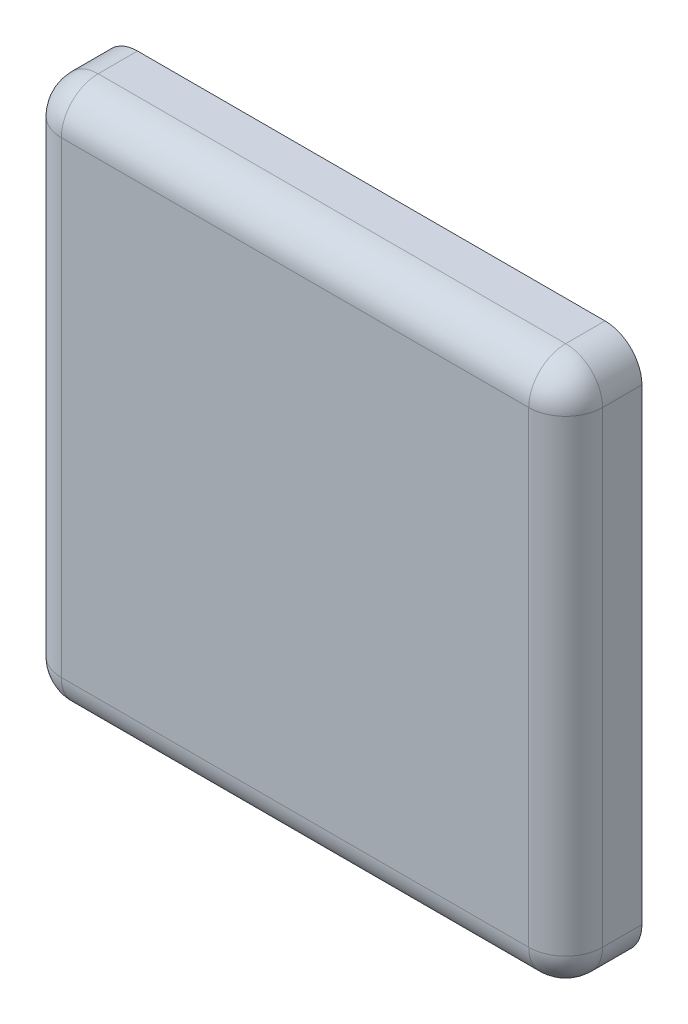
ISO-10303-21;
HEADER;
FILE_DESCRIPTION(('STEP AP214'),'2;1');
FILE_NAME('part.step','',(''),(''),'','','');
FILE_SCHEMA(('AUTOMOTIVE_DESIGN { 1 0 10303 214 1 1 1 1 }'));
ENDSEC;
DATA;
#1=APPLICATION_CONTEXT('core data for automotive mechanical design processes');
#2=APPLICATION_PROTOCOL_DEFINITION('international standard','automotive_design',2000,#1);
#3=PRODUCT_CONTEXT('',#1,'mechanical');
#4=PRODUCT('Part','Part','',(#3));
#5=PRODUCT_RELATED_PRODUCT_CATEGORY('part','',(#4));
#6=PRODUCT_DEFINITION_FORMATION('','',#4);
#7=PRODUCT_DEFINITION_CONTEXT('part definition',#1,'design');
#8=PRODUCT_DEFINITION('design','',#6,#7);
#9=PRODUCT_DEFINITION_SHAPE('','',#8);
#10=(LENGTH_UNIT() NAMED_UNIT(*) SI_UNIT(.MILLI.,.METRE.));
#11=(NAMED_UNIT(*) PLANE_ANGLE_UNIT() SI_UNIT($,.RADIAN.));
#12=(NAMED_UNIT(*) SI_UNIT($,.STERADIAN.) SOLID_ANGLE_UNIT());
#13=UNCERTAINTY_MEASURE_WITH_UNIT(LENGTH_MEASURE(1.E-05),#10,'distance_accuracy_value','');
#14=(GEOMETRIC_REPRESENTATION_CONTEXT(3) GLOBAL_UNCERTAINTY_ASSIGNED_CONTEXT((#13)) GLOBAL_UNIT_ASSIGNED_CONTEXT((#10,
#11,#12)) REPRESENTATION_CONTEXT('',''));
#15=CARTESIAN_POINT('',(0.,0.,0.));
#16=DIRECTION('',(0.,0.,1.));
#17=DIRECTION('',(1.,0.,0.));
#18=AXIS2_PLACEMENT_3D('',#15,#16,#17);
#19=CARTESIAN_POINT('',(0.,0.,3.1));
#20=DIRECTION('',(1.,0.,0.));
#21=DIRECTION('',(0.,1.,0.));
#22=AXIS2_PLACEMENT_3D('',#19,#20,#21);
#23=PLANE('',#22);
#24=DIRECTION('',(0.,-1.,0.));
#25=VECTOR('',#24,1.);
#26=CARTESIAN_POINT('',(0.,0.,0.));
#27=LINE('',#26,#25);
#28=CARTESIAN_POINT('',(0.,20.5,0.));
#29=VERTEX_POINT('',#28);
#30=CARTESIAN_POINT('',(0.,1.5,0.));
#31=VERTEX_POINT('',#30);
#32=EDGE_CURVE('E139',#29,#31,#27,.T.);
#33=ORIENTED_EDGE('',*,*,#32,.T.);
#34=DIRECTION('',(0.,0.,-1.));
#35=VECTOR('',#34,1.);
#36=CARTESIAN_POINT('',(0.,1.5,3.1));
#37=LINE('',#36,#35);
#38=CARTESIAN_POINT('',(0.,1.5,1.6));
#39=VERTEX_POINT('',#38);
#40=EDGE_CURVE('E157',#31,#39,#37,.F.);
#41=ORIENTED_EDGE('',*,*,#40,.T.);
#42=DIRECTION('',(0.,-1.,0.));
#43=VECTOR('',#42,1.);
#44=CARTESIAN_POINT('',(0.,0.,1.6));
#45=LINE('',#44,#43);
#46=CARTESIAN_POINT('',(0.,20.5,1.6));
#47=VERTEX_POINT('',#46);
#48=EDGE_CURVE('E153',#39,#47,#45,.F.);
#49=ORIENTED_EDGE('',*,*,#48,.T.);
#50=DIRECTION('',(0.,0.,-1.));
#51=VECTOR('',#50,1.);
#52=CARTESIAN_POINT('',(0.,20.5,3.1));
#53=LINE('',#52,#51);
#54=EDGE_CURVE('E155',#47,#29,#53,.T.);
#55=ORIENTED_EDGE('',*,*,#54,.T.);
#56=EDGE_LOOP('',(#33,#41,#49,#55));
#57=FACE_BOUND('',#56,.T.);
#58=ADVANCED_FACE('F30',(#57),#23,.F.);
#59=CARTESIAN_POINT('',(0.,0.,3.1));
#60=DIRECTION('',(0.,1.,0.));
#61=DIRECTION('',(0.,0.,1.));
#62=AXIS2_PLACEMENT_3D('',#59,#60,#61);
#63=PLANE('',#62);
#64=DIRECTION('',(1.,0.,0.));
#65=VECTOR('',#64,1.);
#66=CARTESIAN_POINT('',(0.,0.,0.));
#67=LINE('',#66,#65);
#68=CARTESIAN_POINT('',(1.5,0.,0.));
#69=VERTEX_POINT('',#68);
#70=CARTESIAN_POINT('',(20.5,0.,0.));
#71=VERTEX_POINT('',#70);
#72=EDGE_CURVE('E135',#69,#71,#67,.T.);
#73=ORIENTED_EDGE('',*,*,#72,.T.);
#74=DIRECTION('',(0.,0.,-1.));
#75=VECTOR('',#74,1.);
#76=CARTESIAN_POINT('',(20.5,0.,3.1));
#77=LINE('',#76,#75);
#78=CARTESIAN_POINT('',(20.5,0.,1.6));
#79=VERTEX_POINT('',#78);
#80=EDGE_CURVE('E112',#71,#79,#77,.F.);
#81=ORIENTED_EDGE('',*,*,#80,.T.);
#82=DIRECTION('',(1.,0.,0.));
#83=VECTOR('',#82,1.);
#84=CARTESIAN_POINT('',(0.,0.,1.6));
#85=LINE('',#84,#83);
#86=CARTESIAN_POINT('',(1.5,0.,1.6));
#87=VERTEX_POINT('',#86);
#88=EDGE_CURVE('E117',#79,#87,#85,.F.);
#89=ORIENTED_EDGE('',*,*,#88,.T.);
#90=DIRECTION('',(0.,0.,-1.));
#91=VECTOR('',#90,1.);
#92=CARTESIAN_POINT('',(1.5,0.,3.1));
#93=LINE('',#92,#91);
#94=EDGE_CURVE('E150',#87,#69,#93,.T.);
#95=ORIENTED_EDGE('',*,*,#94,.T.);
#96=EDGE_LOOP('',(#73,#81,#89,#95));
#97=FACE_BOUND('',#96,.T.);
#98=ADVANCED_FACE('F246',(#97),#63,.F.);
#99=CARTESIAN_POINT('',(22.,0.,3.1));
#100=DIRECTION('',(-1.,0.,0.));
#101=DIRECTION('',(0.,0.,1.));
#102=AXIS2_PLACEMENT_3D('',#99,#100,#101);
#103=PLANE('',#102);
#104=DIRECTION('',(0.,1.,0.));
#105=VECTOR('',#104,1.);
#106=CARTESIAN_POINT('',(22.,0.,1.6));
#107=LINE('',#106,#105);
#108=CARTESIAN_POINT('',(22.,20.5,1.6));
#109=VERTEX_POINT('',#108);
#110=CARTESIAN_POINT('',(22.,1.5,1.6));
#111=VERTEX_POINT('',#110);
#112=EDGE_CURVE('E126',#109,#111,#107,.F.);
#113=ORIENTED_EDGE('',*,*,#112,.T.);
#114=DIRECTION('',(0.,0.,-1.));
#115=VECTOR('',#114,1.);
#116=CARTESIAN_POINT('',(22.,1.5,3.1));
#117=LINE('',#116,#115);
#118=CARTESIAN_POINT('',(22.,1.5,0.));
#119=VERTEX_POINT('',#118);
#120=EDGE_CURVE('E111',#111,#119,#117,.T.);
#121=ORIENTED_EDGE('',*,*,#120,.T.);
#122=DIRECTION('',(0.,1.,0.));
#123=VECTOR('',#122,1.);
#124=CARTESIAN_POINT('',(22.,0.,0.));
#125=LINE('',#124,#123);
#126=CARTESIAN_POINT('',(22.,20.5,0.));
#127=VERTEX_POINT('',#126);
#128=EDGE_CURVE('E123',#119,#127,#125,.T.);
#129=ORIENTED_EDGE('',*,*,#128,.T.);
#130=DIRECTION('',(0.,0.,-1.));
#131=VECTOR('',#130,1.);
#132=CARTESIAN_POINT('',(22.,20.5,3.1));
#133=LINE('',#132,#131);
#134=EDGE_CURVE('E129',#127,#109,#133,.F.);
#135=ORIENTED_EDGE('',*,*,#134,.T.);
#136=EDGE_LOOP('',(#113,#121,#129,#135));
#137=FACE_BOUND('',#136,.T.);
#138=ADVANCED_FACE('F122',(#137),#103,.F.);
#139=CARTESIAN_POINT('',(0.,22.,3.1));
#140=DIRECTION('',(0.,-1.,0.));
#141=DIRECTION('',(0.,0.,-1.));
#142=AXIS2_PLACEMENT_3D('',#139,#140,#141);
#143=PLANE('',#142);
#144=DIRECTION('',(-1.,0.,0.));
#145=VECTOR('',#144,1.);
#146=CARTESIAN_POINT('',(0.,22.,0.));
#147=LINE('',#146,#145);
#148=CARTESIAN_POINT('',(20.5,22.,0.));
#149=VERTEX_POINT('',#148);
#150=CARTESIAN_POINT('',(1.5,22.,0.));
#151=VERTEX_POINT('',#150);
#152=EDGE_CURVE('E134',#149,#151,#147,.T.);
#153=ORIENTED_EDGE('',*,*,#152,.T.);
#154=DIRECTION('',(0.,0.,-1.));
#155=VECTOR('',#154,1.);
#156=CARTESIAN_POINT('',(1.5,22.,3.1));
#157=LINE('',#156,#155);
#158=CARTESIAN_POINT('',(1.5,22.,1.6));
#159=VERTEX_POINT('',#158);
#160=EDGE_CURVE('E163',#151,#159,#157,.F.);
#161=ORIENTED_EDGE('',*,*,#160,.T.);
#162=DIRECTION('',(-1.,0.,0.));
#163=VECTOR('',#162,1.);
#164=CARTESIAN_POINT('',(0.,22.,1.6));
#165=LINE('',#164,#163);
#166=CARTESIAN_POINT('',(20.5,22.,1.6));
#167=VERTEX_POINT('',#166);
#168=EDGE_CURVE('E159',#159,#167,#165,.F.);
#169=ORIENTED_EDGE('',*,*,#168,.T.);
#170=DIRECTION('',(0.,0.,-1.));
#171=VECTOR('',#170,1.);
#172=CARTESIAN_POINT('',(20.5,22.,3.1));
#173=LINE('',#172,#171);
#174=EDGE_CURVE('E161',#167,#149,#173,.T.);
#175=ORIENTED_EDGE('',*,*,#174,.T.);
#176=EDGE_LOOP('',(#153,#161,#169,#175));
#177=FACE_BOUND('',#176,.T.);
#178=ADVANCED_FACE('F223',(#177),#143,.F.);
#179=CARTESIAN_POINT('',(0.,22.,3.1));
#180=DIRECTION('',(0.,0.,-1.));
#181=DIRECTION('',(-1.,0.,0.));
#182=AXIS2_PLACEMENT_3D('',#179,#180,#181);
#183=PLANE('',#182);
#184=DIRECTION('',(1.,0.,0.));
#185=VECTOR('',#184,1.);
#186=CARTESIAN_POINT('',(0.,1.5,3.1));
#187=LINE('',#186,#185);
#188=CARTESIAN_POINT('',(1.5,1.5,3.1));
#189=VERTEX_POINT('',#188);
#190=CARTESIAN_POINT('',(20.5,1.5,3.1));
#191=VERTEX_POINT('',#190);
#192=EDGE_CURVE('E39',#189,#191,#187,.T.);
#193=ORIENTED_EDGE('',*,*,#192,.T.);
#194=DIRECTION('',(0.,1.,0.));
#195=VECTOR('',#194,1.);
#196=CARTESIAN_POINT('',(20.5,22.,3.1));
#197=LINE('',#196,#195);
#198=CARTESIAN_POINT('',(20.5,20.5,3.1));
#199=VERTEX_POINT('',#198);
#200=EDGE_CURVE('E11',#191,#199,#197,.T.);
#201=ORIENTED_EDGE('',*,*,#200,.T.);
#202=DIRECTION('',(-1.,0.,0.));
#203=VECTOR('',#202,1.);
#204=CARTESIAN_POINT('',(0.,20.5,3.1));
#205=LINE('',#204,#203);
#206=CARTESIAN_POINT('',(1.5,20.5,3.1));
#207=VERTEX_POINT('',#206);
#208=EDGE_CURVE('E165',#199,#207,#205,.T.);
#209=ORIENTED_EDGE('',*,*,#208,.T.);
#210=DIRECTION('',(0.,-1.,0.));
#211=VECTOR('',#210,1.);
#212=CARTESIAN_POINT('',(1.5,22.,3.1));
#213=LINE('',#212,#211);
#214=EDGE_CURVE('E50',#207,#189,#213,.T.);
#215=ORIENTED_EDGE('',*,*,#214,.T.);
#216=EDGE_LOOP('',(#193,#201,#209,#215));
#217=FACE_BOUND('',#216,.T.);
#218=ADVANCED_FACE('F284',(#217),#183,.F.);
#219=CARTESIAN_POINT('',(0.,22.,0.));
#220=DIRECTION('',(0.,0.,-1.));
#221=DIRECTION('',(-1.,0.,0.));
#222=AXIS2_PLACEMENT_3D('',#219,#220,#221);
#223=PLANE('',#222);
#224=ORIENTED_EDGE('',*,*,#128,.F.);
#225=CARTESIAN_POINT('',(20.5,1.5,0.));
#226=DIRECTION('',(0.,0.,-1.));
#227=DIRECTION('',(-1.,0.,0.));
#228=AXIS2_PLACEMENT_3D('',#225,#226,#227);
#229=CIRCLE('',#228,1.5);
#230=EDGE_CURVE('E107',#119,#71,#229,.T.);
#231=ORIENTED_EDGE('',*,*,#230,.T.);
#232=ORIENTED_EDGE('',*,*,#72,.F.);
#233=CARTESIAN_POINT('',(1.5,1.5,0.));
#234=DIRECTION('',(0.,0.,-1.));
#235=DIRECTION('',(-1.,0.,0.));
#236=AXIS2_PLACEMENT_3D('',#233,#234,#235);
#237=CIRCLE('',#236,1.5);
#238=EDGE_CURVE('E118',#69,#31,#237,.T.);
#239=ORIENTED_EDGE('',*,*,#238,.T.);
#240=ORIENTED_EDGE('',*,*,#32,.F.);
#241=CARTESIAN_POINT('',(1.5,20.5,0.));
#242=DIRECTION('',(0.,0.,-1.));
#243=DIRECTION('',(-1.,0.,0.));
#244=AXIS2_PLACEMENT_3D('',#241,#242,#243);
#245=CIRCLE('',#244,1.5);
#246=EDGE_CURVE('E146',#29,#151,#245,.T.);
#247=ORIENTED_EDGE('',*,*,#246,.T.);
#248=ORIENTED_EDGE('',*,*,#152,.F.);
#249=CARTESIAN_POINT('',(20.5,20.5,0.));
#250=DIRECTION('',(0.,0.,-1.));
#251=DIRECTION('',(-1.,0.,0.));
#252=AXIS2_PLACEMENT_3D('',#249,#250,#251);
#253=CIRCLE('',#252,1.5);
#254=EDGE_CURVE('E128',#149,#127,#253,.T.);
#255=ORIENTED_EDGE('',*,*,#254,.T.);
#256=EDGE_LOOP('',(#224,#231,#232,#239,#240,#247,#248,#255));
#257=FACE_BOUND('',#256,.T.);
#258=ADVANCED_FACE('F131',(#257),#223,.T.);
#259=CARTESIAN_POINT('',(1.5,20.5,3.1));
#260=DIRECTION('',(0.,0.,-1.));
#261=DIRECTION('',(-1.,0.,0.));
#262=AXIS2_PLACEMENT_3D('',#259,#260,#261);
#263=CYLINDRICAL_SURFACE('',#262,1.5);
#264=CARTESIAN_POINT('',(1.5,20.5,1.6));
#265=DIRECTION('',(0.,0.,1.));
#266=DIRECTION('',(1.,0.,0.));
#267=AXIS2_PLACEMENT_3D('',#264,#265,#266);
#268=CIRCLE('',#267,1.5);
#269=EDGE_CURVE('E34',#159,#47,#268,.T.);
#270=ORIENTED_EDGE('',*,*,#269,.F.);
#271=ORIENTED_EDGE('',*,*,#160,.F.);
#272=ORIENTED_EDGE('',*,*,#246,.F.);
#273=ORIENTED_EDGE('',*,*,#54,.F.);
#274=EDGE_LOOP('',(#270,#271,#272,#273));
#275=FACE_BOUND('',#274,.T.);
#276=ADVANCED_FACE('F32',(#275),#263,.T.);
#277=CARTESIAN_POINT('',(1.5,20.5,1.6));
#278=DIRECTION('',(0.,0.,1.));
#279=DIRECTION('',(1.,0.,0.));
#280=AXIS2_PLACEMENT_3D('',#277,#278,#279);
#281=SPHERICAL_SURFACE('',#280,1.5);
#282=CARTESIAN_POINT('',(1.5,20.5,1.6));
#283=DIRECTION('',(-1.,0.,0.));
#284=DIRECTION('',(0.,0.,1.));
#285=AXIS2_PLACEMENT_3D('',#282,#283,#284);
#286=CIRCLE('',#285,1.5);
#287=EDGE_CURVE('E194',#159,#207,#286,.F.);
#288=ORIENTED_EDGE('',*,*,#287,.F.);
#289=ORIENTED_EDGE('',*,*,#269,.T.);
#290=CARTESIAN_POINT('',(1.5,20.5,1.6));
#291=DIRECTION('',(0.,1.,0.));
#292=DIRECTION('',(0.,0.,1.));
#293=AXIS2_PLACEMENT_3D('',#290,#291,#292);
#294=CIRCLE('',#293,1.5);
#295=EDGE_CURVE('E196',#207,#47,#294,.F.);
#296=ORIENTED_EDGE('',*,*,#295,.F.);
#297=EDGE_LOOP('',(#288,#289,#296));
#298=FACE_BOUND('',#297,.T.);
#299=ADVANCED_FACE('F276',(#298),#281,.T.);
#300=CARTESIAN_POINT('',(1.5,1.5,3.1));
#301=DIRECTION('',(0.,0.,-1.));
#302=DIRECTION('',(-1.,0.,0.));
#303=AXIS2_PLACEMENT_3D('',#300,#301,#302);
#304=CYLINDRICAL_SURFACE('',#303,1.5);
#305=ORIENTED_EDGE('',*,*,#238,.F.);
#306=ORIENTED_EDGE('',*,*,#94,.F.);
#307=CARTESIAN_POINT('',(1.5,1.5,1.6));
#308=DIRECTION('',(0.,0.,1.));
#309=DIRECTION('',(1.,0.,0.));
#310=AXIS2_PLACEMENT_3D('',#307,#308,#309);
#311=CIRCLE('',#310,1.5);
#312=EDGE_CURVE('E191',#39,#87,#311,.T.);
#313=ORIENTED_EDGE('',*,*,#312,.F.);
#314=ORIENTED_EDGE('',*,*,#40,.F.);
#315=EDGE_LOOP('',(#305,#306,#313,#314));
#316=FACE_BOUND('',#315,.T.);
#317=ADVANCED_FACE('F214',(#316),#304,.T.);
#318=CARTESIAN_POINT('',(1.5,22.,1.6));
#319=DIRECTION('',(0.,-1.,0.));
#320=DIRECTION('',(1.,0.,0.));
#321=AXIS2_PLACEMENT_3D('',#318,#319,#320);
#322=CYLINDRICAL_SURFACE('',#321,1.5);
#323=ORIENTED_EDGE('',*,*,#295,.T.);
#324=ORIENTED_EDGE('',*,*,#48,.F.);
#325=CARTESIAN_POINT('',(1.5,1.5,1.6));
#326=DIRECTION('',(0.,-1.,0.));
#327=DIRECTION('',(1.,0.,0.));
#328=AXIS2_PLACEMENT_3D('',#325,#326,#327);
#329=CIRCLE('',#328,1.5);
#330=EDGE_CURVE('E188',#189,#39,#329,.T.);
#331=ORIENTED_EDGE('',*,*,#330,.F.);
#332=ORIENTED_EDGE('',*,*,#214,.F.);
#333=EDGE_LOOP('',(#323,#324,#331,#332));
#334=FACE_BOUND('',#333,.T.);
#335=ADVANCED_FACE('F219',(#334),#322,.T.);
#336=CARTESIAN_POINT('',(0.,20.5,1.6));
#337=DIRECTION('',(-1.,0.,0.));
#338=DIRECTION('',(0.,0.,1.));
#339=AXIS2_PLACEMENT_3D('',#336,#337,#338);
#340=CYLINDRICAL_SURFACE('',#339,1.5);
#341=ORIENTED_EDGE('',*,*,#287,.T.);
#342=ORIENTED_EDGE('',*,*,#208,.F.);
#343=CARTESIAN_POINT('',(20.5,20.5,1.6));
#344=DIRECTION('',(1.,0.,0.));
#345=DIRECTION('',(0.,0.,-1.));
#346=AXIS2_PLACEMENT_3D('',#343,#344,#345);
#347=CIRCLE('',#346,1.5);
#348=EDGE_CURVE('E185',#167,#199,#347,.T.);
#349=ORIENTED_EDGE('',*,*,#348,.F.);
#350=ORIENTED_EDGE('',*,*,#168,.F.);
#351=EDGE_LOOP('',(#341,#342,#349,#350));
#352=FACE_BOUND('',#351,.T.);
#353=ADVANCED_FACE('F233',(#352),#340,.T.);
#354=CARTESIAN_POINT('',(20.5,20.5,3.1));
#355=DIRECTION('',(0.,0.,-1.));
#356=DIRECTION('',(-1.,0.,0.));
#357=AXIS2_PLACEMENT_3D('',#354,#355,#356);
#358=CYLINDRICAL_SURFACE('',#357,1.5);
#359=ORIENTED_EDGE('',*,*,#254,.F.);
#360=ORIENTED_EDGE('',*,*,#174,.F.);
#361=CARTESIAN_POINT('',(20.5,20.5,1.6));
#362=DIRECTION('',(0.,0.,1.));
#363=DIRECTION('',(1.,0.,0.));
#364=AXIS2_PLACEMENT_3D('',#361,#362,#363);
#365=CIRCLE('',#364,1.5);
#366=EDGE_CURVE('E182',#109,#167,#365,.T.);
#367=ORIENTED_EDGE('',*,*,#366,.F.);
#368=ORIENTED_EDGE('',*,*,#134,.F.);
#369=EDGE_LOOP('',(#359,#360,#367,#368));
#370=FACE_BOUND('',#369,.T.);
#371=ADVANCED_FACE('F229',(#370),#358,.T.);
#372=CARTESIAN_POINT('',(1.5,1.5,1.6));
#373=DIRECTION('',(0.,0.,1.));
#374=DIRECTION('',(1.,0.,0.));
#375=AXIS2_PLACEMENT_3D('',#372,#373,#374);
#376=SPHERICAL_SURFACE('',#375,1.5);
#377=ORIENTED_EDGE('',*,*,#330,.T.);
#378=ORIENTED_EDGE('',*,*,#312,.T.);
#379=CARTESIAN_POINT('',(1.5,1.5,1.6));
#380=DIRECTION('',(-1.,0.,0.));
#381=DIRECTION('',(0.,0.,1.));
#382=AXIS2_PLACEMENT_3D('',#379,#380,#381);
#383=CIRCLE('',#382,1.5);
#384=EDGE_CURVE('E179',#189,#87,#383,.F.);
#385=ORIENTED_EDGE('',*,*,#384,.F.);
#386=EDGE_LOOP('',(#377,#378,#385));
#387=FACE_BOUND('',#386,.T.);
#388=ADVANCED_FACE('F218',(#387),#376,.T.);
#389=CARTESIAN_POINT('',(20.5,20.5,1.6));
#390=DIRECTION('',(0.,0.,1.));
#391=DIRECTION('',(1.,0.,0.));
#392=AXIS2_PLACEMENT_3D('',#389,#390,#391);
#393=SPHERICAL_SURFACE('',#392,1.5);
#394=ORIENTED_EDGE('',*,*,#366,.T.);
#395=ORIENTED_EDGE('',*,*,#348,.T.);
#396=CARTESIAN_POINT('',(20.5,20.5,1.6));
#397=DIRECTION('',(0.,1.,0.));
#398=DIRECTION('',(0.,0.,1.));
#399=AXIS2_PLACEMENT_3D('',#396,#397,#398);
#400=CIRCLE('',#399,1.5);
#401=EDGE_CURVE('E177',#109,#199,#400,.F.);
#402=ORIENTED_EDGE('',*,*,#401,.F.);
#403=EDGE_LOOP('',(#394,#395,#402));
#404=FACE_BOUND('',#403,.T.);
#405=ADVANCED_FACE('F235',(#404),#393,.T.);
#406=CARTESIAN_POINT('',(0.,1.5,1.6));
#407=DIRECTION('',(1.,0.,0.));
#408=DIRECTION('',(0.,0.,-1.));
#409=AXIS2_PLACEMENT_3D('',#406,#407,#408);
#410=CYLINDRICAL_SURFACE('',#409,1.5);
#411=ORIENTED_EDGE('',*,*,#384,.T.);
#412=ORIENTED_EDGE('',*,*,#88,.F.);
#413=CARTESIAN_POINT('',(20.5,1.5,1.6));
#414=DIRECTION('',(1.,0.,0.));
#415=DIRECTION('',(0.,0.,-1.));
#416=AXIS2_PLACEMENT_3D('',#413,#414,#415);
#417=CIRCLE('',#416,1.5);
#418=EDGE_CURVE('E174',#191,#79,#417,.T.);
#419=ORIENTED_EDGE('',*,*,#418,.F.);
#420=ORIENTED_EDGE('',*,*,#192,.F.);
#421=EDGE_LOOP('',(#411,#412,#419,#420));
#422=FACE_BOUND('',#421,.T.);
#423=ADVANCED_FACE('F244',(#422),#410,.T.);
#424=CARTESIAN_POINT('',(20.5,22.,1.6));
#425=DIRECTION('',(0.,1.,0.));
#426=DIRECTION('',(0.,0.,1.));
#427=AXIS2_PLACEMENT_3D('',#424,#425,#426);
#428=CYLINDRICAL_SURFACE('',#427,1.5);
#429=ORIENTED_EDGE('',*,*,#401,.T.);
#430=ORIENTED_EDGE('',*,*,#200,.F.);
#431=CARTESIAN_POINT('',(20.5,1.5,1.6));
#432=DIRECTION('',(0.,-1.,0.));
#433=DIRECTION('',(0.,0.,-1.));
#434=AXIS2_PLACEMENT_3D('',#431,#432,#433);
#435=CIRCLE('',#434,1.5);
#436=EDGE_CURVE('E171',#111,#191,#435,.T.);
#437=ORIENTED_EDGE('',*,*,#436,.F.);
#438=ORIENTED_EDGE('',*,*,#112,.F.);
#439=EDGE_LOOP('',(#429,#430,#437,#438));
#440=FACE_BOUND('',#439,.T.);
#441=ADVANCED_FACE('F237',(#440),#428,.T.);
#442=CARTESIAN_POINT('',(20.5,1.5,1.6));
#443=DIRECTION('',(0.,0.,1.));
#444=DIRECTION('',(1.,0.,0.));
#445=AXIS2_PLACEMENT_3D('',#442,#443,#444);
#446=SPHERICAL_SURFACE('',#445,1.5);
#447=ORIENTED_EDGE('',*,*,#436,.T.);
#448=ORIENTED_EDGE('',*,*,#418,.T.);
#449=CARTESIAN_POINT('',(20.5,1.5,1.6));
#450=DIRECTION('',(0.,0.,1.));
#451=DIRECTION('',(1.,0.,0.));
#452=AXIS2_PLACEMENT_3D('',#449,#450,#451);
#453=CIRCLE('',#452,1.5);
#454=EDGE_CURVE('E169',#111,#79,#453,.F.);
#455=ORIENTED_EDGE('',*,*,#454,.F.);
#456=EDGE_LOOP('',(#447,#448,#455));
#457=FACE_BOUND('',#456,.T.);
#458=ADVANCED_FACE('F241',(#457),#446,.T.);
#459=CARTESIAN_POINT('',(20.5,1.5,3.1));
#460=DIRECTION('',(0.,0.,-1.));
#461=DIRECTION('',(-1.,0.,0.));
#462=AXIS2_PLACEMENT_3D('',#459,#460,#461);
#463=CYLINDRICAL_SURFACE('',#462,1.5);
#464=ORIENTED_EDGE('',*,*,#454,.T.);
#465=ORIENTED_EDGE('',*,*,#80,.F.);
#466=ORIENTED_EDGE('',*,*,#230,.F.);
#467=ORIENTED_EDGE('',*,*,#120,.F.);
#468=EDGE_LOOP('',(#464,#465,#466,#467));
#469=FACE_BOUND('',#468,.T.);
#470=ADVANCED_FACE('F110',(#469),#463,.T.);
#471=CLOSED_SHELL('',(#58,#98,#138,#178,#218,#258,#276,#299,#317,#335,#353,#371,#388,#405,#423,
#441,#458,#470));
#472=MANIFOLD_SOLID_BREP('B2',#471);
#473=ADVANCED_BREP_SHAPE_REPRESENTATION('',(#18,#472),#14);
#474=SHAPE_DEFINITION_REPRESENTATION(#9,#473);
ENDSEC;
END-ISO-10303-21;
